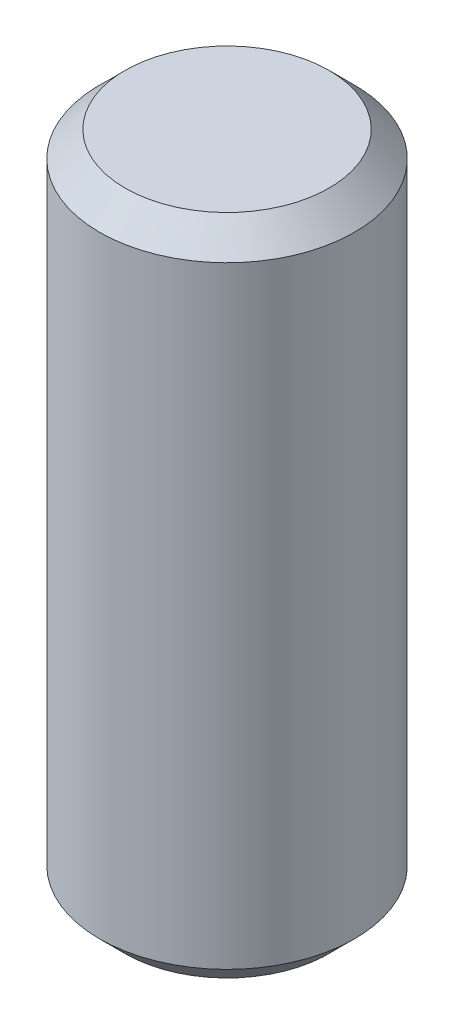
ISO-10303-21;
HEADER;
FILE_DESCRIPTION(('STEP AP214'),'2;1');
FILE_NAME('part.step','',(''),(''),'','','');
FILE_SCHEMA(('AUTOMOTIVE_DESIGN { 1 0 10303 214 1 1 1 1 }'));
ENDSEC;
DATA;
#1=APPLICATION_CONTEXT('core data for automotive mechanical design processes');
#2=APPLICATION_PROTOCOL_DEFINITION('international standard','automotive_design',2000,#1);
#3=PRODUCT_CONTEXT('',#1,'mechanical');
#4=PRODUCT('Part','Part','',(#3));
#5=PRODUCT_RELATED_PRODUCT_CATEGORY('part','',(#4));
#6=PRODUCT_DEFINITION_FORMATION('','',#4);
#7=PRODUCT_DEFINITION_CONTEXT('part definition',#1,'design');
#8=PRODUCT_DEFINITION('design','',#6,#7);
#9=PRODUCT_DEFINITION_SHAPE('','',#8);
#10=(LENGTH_UNIT() NAMED_UNIT(*) SI_UNIT(.MILLI.,.METRE.));
#11=(NAMED_UNIT(*) PLANE_ANGLE_UNIT() SI_UNIT($,.RADIAN.));
#12=(NAMED_UNIT(*) SI_UNIT($,.STERADIAN.) SOLID_ANGLE_UNIT());
#13=UNCERTAINTY_MEASURE_WITH_UNIT(LENGTH_MEASURE(1.E-05),#10,'distance_accuracy_value','');
#14=(GEOMETRIC_REPRESENTATION_CONTEXT(3) GLOBAL_UNCERTAINTY_ASSIGNED_CONTEXT((#13)) GLOBAL_UNIT_ASSIGNED_CONTEXT((#10,
#11,#12)) REPRESENTATION_CONTEXT('',''));
#15=CARTESIAN_POINT('',(0.,0.,0.));
#16=DIRECTION('',(0.,0.,1.));
#17=DIRECTION('',(1.,0.,0.));
#18=AXIS2_PLACEMENT_3D('',#15,#16,#17);
#19=CARTESIAN_POINT('',(0.,52.,0.));
#20=DIRECTION('',(0.,-1.,0.));
#21=DIRECTION('',(0.,0.,-1.));
#22=AXIS2_PLACEMENT_3D('',#19,#20,#21);
#23=CYLINDRICAL_SURFACE('',#22,10.);
#24=CARTESIAN_POINT('',(0.,50.,0.));
#25=DIRECTION('',(0.,1.,0.));
#26=DIRECTION('',(0.,0.,1.));
#27=AXIS2_PLACEMENT_3D('',#24,#25,#26);
#28=CIRCLE('',#27,10.);
#29=CARTESIAN_POINT('',(0.,50.,10.));
#30=VERTEX_POINT('',#29);
#31=EDGE_CURVE('E49',#30,#30,#28,.F.);
#32=ORIENTED_EDGE('',*,*,#31,.T.);
#33=EDGE_LOOP('',(#32));
#34=FACE_BOUND('',#33,.T.);
#35=CARTESIAN_POINT('',(0.,2.00000000000004,0.));
#36=DIRECTION('',(0.,1.,0.));
#37=DIRECTION('',(0.,0.,1.));
#38=AXIS2_PLACEMENT_3D('',#35,#36,#37);
#39=CIRCLE('',#38,10.);
#40=CARTESIAN_POINT('',(0.,2.00000000000004,10.));
#41=VERTEX_POINT('',#40);
#42=EDGE_CURVE('E53',#41,#41,#39,.T.);
#43=ORIENTED_EDGE('',*,*,#42,.T.);
#44=EDGE_LOOP('',(#43));
#45=FACE_BOUND('',#44,.T.);
#46=ADVANCED_FACE('F41',(#34,#45),#23,.T.);
#47=CARTESIAN_POINT('',(0.,52.,0.));
#48=DIRECTION('',(0.,1.,0.));
#49=DIRECTION('',(0.,0.,1.));
#50=AXIS2_PLACEMENT_3D('',#47,#48,#49);
#51=PLANE('',#50);
#52=CARTESIAN_POINT('',(0.,52.,0.));
#53=DIRECTION('',(0.,1.,0.));
#54=DIRECTION('',(0.,0.,1.));
#55=AXIS2_PLACEMENT_3D('',#52,#53,#54);
#56=CIRCLE('',#55,8.00000000000005);
#57=CARTESIAN_POINT('',(0.,52.,8.00000000000005));
#58=VERTEX_POINT('',#57);
#59=EDGE_CURVE('E57',#58,#58,#56,.T.);
#60=ORIENTED_EDGE('',*,*,#59,.T.);
#61=EDGE_LOOP('',(#60));
#62=FACE_BOUND('',#61,.T.);
#63=ADVANCED_FACE('F63',(#62),#51,.T.);
#64=CARTESIAN_POINT('',(0.,0.,0.));
#65=DIRECTION('',(0.,1.,0.));
#66=DIRECTION('',(0.,0.,1.));
#67=AXIS2_PLACEMENT_3D('',#64,#65,#66);
#68=PLANE('',#67);
#69=CARTESIAN_POINT('',(0.,0.,0.));
#70=DIRECTION('',(0.,1.,0.));
#71=DIRECTION('',(0.,0.,1.));
#72=AXIS2_PLACEMENT_3D('',#69,#70,#71);
#73=CIRCLE('',#72,7.99999999999995);
#74=CARTESIAN_POINT('',(0.,0.,7.99999999999995));
#75=VERTEX_POINT('',#74);
#76=EDGE_CURVE('E10',#75,#75,#73,.F.);
#77=ORIENTED_EDGE('',*,*,#76,.T.);
#78=EDGE_LOOP('',(#77));
#79=FACE_BOUND('',#78,.T.);
#80=ADVANCED_FACE('F67',(#79),#68,.F.);
#81=CARTESIAN_POINT('',(0.,52.,0.));
#82=DIRECTION('',(0.,-1.,0.));
#83=DIRECTION('',(0.,0.,-1.));
#84=AXIS2_PLACEMENT_3D('',#81,#82,#83);
#85=CONICAL_SURFACE('',#84,8.00000000000005,0.785398163397447);
#86=ORIENTED_EDGE('',*,*,#31,.F.);
#87=EDGE_LOOP('',(#86));
#88=FACE_BOUND('',#87,.T.);
#89=ORIENTED_EDGE('',*,*,#59,.F.);
#90=EDGE_LOOP('',(#89));
#91=FACE_BOUND('',#90,.T.);
#92=ADVANCED_FACE('F65',(#88,#91),#85,.T.);
#93=CARTESIAN_POINT('',(0.,2.00000000000004,0.));
#94=DIRECTION('',(0.,1.,0.));
#95=DIRECTION('',(0.,0.,1.));
#96=AXIS2_PLACEMENT_3D('',#93,#94,#95);
#97=CONICAL_SURFACE('',#96,10.,0.78539816339745);
#98=ORIENTED_EDGE('',*,*,#76,.F.);
#99=EDGE_LOOP('',(#98));
#100=FACE_BOUND('',#99,.T.);
#101=ORIENTED_EDGE('',*,*,#42,.F.);
#102=EDGE_LOOP('',(#101));
#103=FACE_BOUND('',#102,.T.);
#104=ADVANCED_FACE('F44',(#100,#103),#97,.T.);
#105=CLOSED_SHELL('',(#46,#63,#80,#92,#104));
#106=MANIFOLD_SOLID_BREP('B2',#105);
#107=ADVANCED_BREP_SHAPE_REPRESENTATION('',(#18,#106),#14);
#108=SHAPE_DEFINITION_REPRESENTATION(#9,#107);
ENDSEC;
END-ISO-10303-21;
